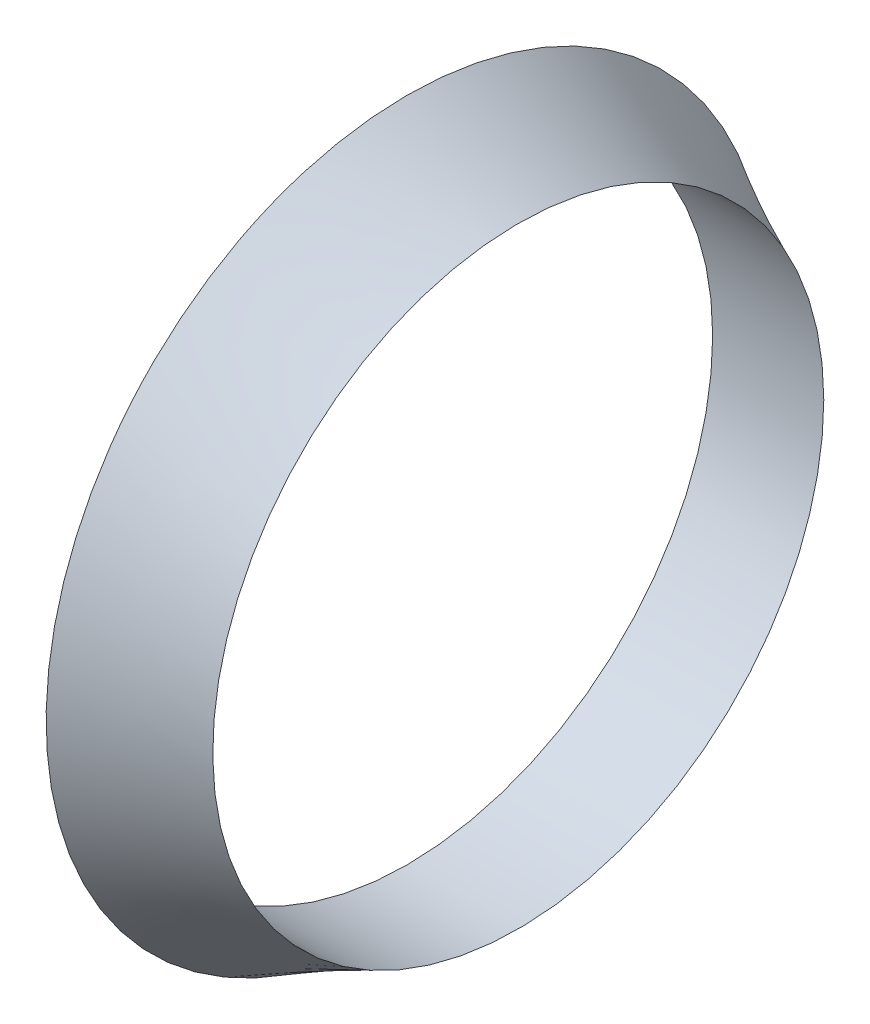
ISO-10303-21;
HEADER;
FILE_DESCRIPTION(('STEP AP214'),'2;1');
FILE_NAME('part.step','',(''),(''),'','','');
FILE_SCHEMA(('AUTOMOTIVE_DESIGN { 1 0 10303 214 1 1 1 1 }'));
ENDSEC;
DATA;
#1=APPLICATION_CONTEXT('core data for automotive mechanical design processes');
#2=APPLICATION_PROTOCOL_DEFINITION('international standard','automotive_design',2000,#1);
#3=PRODUCT_CONTEXT('',#1,'mechanical');
#4=PRODUCT('Part','Part','',(#3));
#5=PRODUCT_RELATED_PRODUCT_CATEGORY('part','',(#4));
#6=PRODUCT_DEFINITION_FORMATION('','',#4);
#7=PRODUCT_DEFINITION_CONTEXT('part definition',#1,'design');
#8=PRODUCT_DEFINITION('design','',#6,#7);
#9=PRODUCT_DEFINITION_SHAPE('','',#8);
#10=(LENGTH_UNIT() NAMED_UNIT(*) SI_UNIT(.MILLI.,.METRE.));
#11=(NAMED_UNIT(*) PLANE_ANGLE_UNIT() SI_UNIT($,.RADIAN.));
#12=(NAMED_UNIT(*) SI_UNIT($,.STERADIAN.) SOLID_ANGLE_UNIT());
#13=UNCERTAINTY_MEASURE_WITH_UNIT(LENGTH_MEASURE(1.E-05),#10,'distance_accuracy_value','');
#14=(GEOMETRIC_REPRESENTATION_CONTEXT(3) GLOBAL_UNCERTAINTY_ASSIGNED_CONTEXT((#13)) GLOBAL_UNIT_ASSIGNED_CONTEXT((#10,
#11,#12)) REPRESENTATION_CONTEXT('',''));
#15=CARTESIAN_POINT('',(0.,0.,0.));
#16=DIRECTION('',(0.,0.,1.));
#17=DIRECTION('',(1.,0.,0.));
#18=AXIS2_PLACEMENT_3D('',#15,#16,#17);
#19=CARTESIAN_POINT('',(0.,0.,0.));
#20=DIRECTION('',(1.,0.,0.));
#21=DIRECTION('',(0.,0.,-1.));
#22=AXIS2_PLACEMENT_3D('',#19,#20,#21);
#23=PLANE('',#22);
#24=CARTESIAN_POINT('',(0.,0.,7.20947868796138E-13));
#25=DIRECTION('',(1.,0.,0.));
#26=DIRECTION('',(0.,0.,-1.));
#27=AXIS2_PLACEMENT_3D('',#24,#25,#26);
#28=CIRCLE('',#27,55.0000000000001);
#29=CARTESIAN_POINT('',(0.,0.,-54.9999999999993));
#30=VERTEX_POINT('',#29);
#31=EDGE_CURVE('E51',#30,#30,#28,.T.);
#32=ORIENTED_EDGE('',*,*,#31,.T.);
#33=EDGE_LOOP('',(#32));
#34=FACE_BOUND('',#33,.T.);
#35=CARTESIAN_POINT('',(0.,0.,0.));
#36=DIRECTION('',(1.,0.,0.));
#37=DIRECTION('',(0.,0.,-1.));
#38=AXIS2_PLACEMENT_3D('',#35,#36,#37);
#39=CIRCLE('',#38,65.);
#40=CARTESIAN_POINT('',(0.,-52.5620886920741,-38.2390746792667));
#41=VERTEX_POINT('',#40);
#42=EDGE_CURVE('E11',#41,#41,#39,.T.);
#43=ORIENTED_EDGE('',*,*,#42,.F.);
#44=EDGE_LOOP('',(#43));
#45=FACE_BOUND('',#44,.T.);
#46=ADVANCED_FACE('F42',(#34,#45),#23,.F.);
#47=CARTESIAN_POINT('',(20.0000000000003,-35.7984123857661,-41.7549239091458));
#48=CARTESIAN_POINT('',(0.,-52.5620886920741,-38.2390746792667));
#49=CARTESIAN_POINT('',(19.9999999999998,-119.308260204059,29.8419008623865));
#50=CARTESIAN_POINT('',(0.,-129.040238050608,66.8851027048815));
#51=CARTESIAN_POINT('',(19.9999999999992,-47.7114354325271,113.35174868068));
#52=CARTESIAN_POINT('',(0.,-23.9160606664593,143.363252063415));
#53=CARTESIAN_POINT('',(19.9999999999997,35.7984123857662,41.7549239091475));
#54=CARTESIAN_POINT('',(0.,52.5620886920741,38.2390746792667));
#55=CARTESIAN_POINT('',(20.0000000000002,119.308260204059,-29.8419008623849));
#56=CARTESIAN_POINT('',(0.,129.040238050608,-66.8851027048813));
#57=CARTESIAN_POINT('',(20.0000000000008,47.7114354325271,-113.351748680678));
#58=CARTESIAN_POINT('',(0.,23.9160606664594,-143.363252063415));
#59=CARTESIAN_POINT('',(20.0000000000003,-35.7984123857661,-41.7549239091458));
#60=CARTESIAN_POINT('',(0.,-52.5620886920741,-38.2390746792667));
#61=(BOUNDED_SURFACE() B_SPLINE_SURFACE(3,1,((#47,#48),(#49,#50),(#51,#52),(#53,#54),(#55,#56),
(#57,#58),(#59,#60)),.UNSPECIFIED.,.T.,.F.,.F.) B_SPLINE_SURFACE_WITH_KNOTS((4,3,4),(2,2),(0.,
0.5,1.),(0.,1.),.UNSPECIFIED.) GEOMETRIC_REPRESENTATION_ITEM() RATIONAL_B_SPLINE_SURFACE(((1.,
1.),(0.333333333333333,0.333333333333333),(0.333333333333333,0.333333333333333),(1.,1.),
(0.333333333333333,0.333333333333334),(0.333333333333333,0.333333333333334),(1.,1.))) REPRESENTATION_ITEM('') SURFACE());
#62=CARTESIAN_POINT('',(20.,0.,8.60607122349863E-13));
#63=DIRECTION('',(1.,0.,0.));
#64=DIRECTION('',(0.,0.,-1.));
#65=AXIS2_PLACEMENT_3D('',#62,#63,#64);
#66=CIRCLE('',#65,55.0000000000001);
#67=CARTESIAN_POINT('',(20.0000000000003,-35.7984123857661,-41.7549239091458));
#68=VERTEX_POINT('',#67);
#69=EDGE_CURVE('E59',#68,#68,#66,.T.);
#70=CARTESIAN_POINT('',(20.0000000000003,-35.7984123857661,-41.7549239091458));
#71=CARTESIAN_POINT('',(19.791666666667,-35.9730340139568,-41.7183004796679));
#72=CARTESIAN_POINT('',(19.5833333333336,-36.1476556421476,-41.68167705019));
#73=CARTESIAN_POINT('',(19.1666666666669,-36.496898898529,-41.6084301912341));
#74=CARTESIAN_POINT('',(18.9583333333336,-36.6715205267197,-41.5718067617562));
#75=CARTESIAN_POINT('',(18.5416666666669,-37.0207637831011,-41.4985599028004));
#76=CARTESIAN_POINT('',(18.3333333333336,-37.1953854112918,-41.4619364733225));
#77=CARTESIAN_POINT('',(17.9166666666669,-37.5446286676732,-41.3886896143667));
#78=CARTESIAN_POINT('',(17.7083333333336,-37.7192502958639,-41.3520661848888));
#79=CARTESIAN_POINT('',(17.2916666666669,-38.0684935522454,-41.278819325933));
#80=CARTESIAN_POINT('',(17.0833333333336,-38.243115180436,-41.2421958964551));
#81=CARTESIAN_POINT('',(16.6666666666669,-38.5923584368175,-41.1689490374993));
#82=CARTESIAN_POINT('',(16.4583333333336,-38.7669800650082,-41.1323256080214));
#83=CARTESIAN_POINT('',(16.0416666666669,-39.1162233213896,-41.0590787490655));
#84=CARTESIAN_POINT('',(15.8333333333336,-39.2908449495803,-41.0224553195876));
#85=CARTESIAN_POINT('',(15.4166666666669,-39.6400882059617,-40.9492084606318));
#86=CARTESIAN_POINT('',(15.2083333333336,-39.8147098341524,-40.9125850311539));
#87=CARTESIAN_POINT('',(14.7916666666669,-40.1639530905338,-40.8393381721981));
#88=CARTESIAN_POINT('',(14.5833333333335,-40.3385747187245,-40.8027147427202));
#89=CARTESIAN_POINT('',(14.1666666666669,-40.687817975106,-40.7294678837644));
#90=CARTESIAN_POINT('',(13.9583333333335,-40.8624396032967,-40.6928444542865));
#91=CARTESIAN_POINT('',(13.5416666666669,-41.2116828596781,-40.6195975953307));
#92=CARTESIAN_POINT('',(13.3333333333335,-41.3863044878688,-40.5829741658527));
#93=CARTESIAN_POINT('',(12.9166666666669,-41.7355477442502,-40.5097273068969));
#94=CARTESIAN_POINT('',(12.7083333333335,-41.9101693724409,-40.473103877419));
#95=CARTESIAN_POINT('',(12.2916666666668,-42.2594126288223,-40.3998570184632));
#96=CARTESIAN_POINT('',(12.0833333333335,-42.434034257013,-40.3632335889853));
#97=CARTESIAN_POINT('',(11.6666666666668,-42.7832775133945,-40.2899867300295));
#98=CARTESIAN_POINT('',(11.4583333333335,-42.9578991415852,-40.2533633005516));
#99=CARTESIAN_POINT('',(11.0416666666668,-43.3071423979666,-40.1801164415958));
#100=CARTESIAN_POINT('',(10.8333333333335,-43.4817640261573,-40.1434930121179));
#101=CARTESIAN_POINT('',(10.4166666666668,-43.8310072825387,-40.0702461531621));
#102=CARTESIAN_POINT('',(10.2083333333335,-44.0056289107294,-40.0336227236842));
#103=CARTESIAN_POINT('',(9.79166666666681,-44.3548721671108,-39.9603758647283));
#104=CARTESIAN_POINT('',(9.58333333333347,-44.5294937953015,-39.9237524352504));
#105=CARTESIAN_POINT('',(9.1666666666668,-44.878737051683,-39.8505055762946));
#106=CARTESIAN_POINT('',(8.95833333333346,-45.0533586798737,-39.8138821468167));
#107=CARTESIAN_POINT('',(8.54166666666679,-45.4026019362551,-39.7406352878609));
#108=CARTESIAN_POINT('',(8.33333333333345,-45.5772235644458,-39.704011858383));
#109=CARTESIAN_POINT('',(7.91666666666678,-45.9264668208272,-39.6307649994272));
#110=CARTESIAN_POINT('',(7.70833333333345,-46.1010884490179,-39.5941415699493));
#111=CARTESIAN_POINT('',(7.29166666666677,-46.4503317053993,-39.5208947109935));
#112=CARTESIAN_POINT('',(7.08333333333344,-46.62495333359,-39.4842712815156));
#113=CARTESIAN_POINT('',(6.66666666666676,-46.9741965899714,-39.4110244225597));
#114=CARTESIAN_POINT('',(6.45833333333343,-47.1488182181622,-39.3744009930818));
#115=CARTESIAN_POINT('',(6.04166666666676,-47.4980614745436,-39.301154134126));
#116=CARTESIAN_POINT('',(5.83333333333342,-47.6726831027343,-39.2645307046481));
#117=CARTESIAN_POINT('',(5.41666666666675,-48.0219263591157,-39.1912838456923));
#118=CARTESIAN_POINT('',(5.20833333333341,-48.1965479873064,-39.1546604162144));
#119=CARTESIAN_POINT('',(4.79166666666674,-48.5457912436878,-39.0814135572586));
#120=CARTESIAN_POINT('',(4.5833333333334,-48.7204128718785,-39.0447901277807));
#121=CARTESIAN_POINT('',(4.16666666666673,-49.06965612826,-38.9715432688249));
#122=CARTESIAN_POINT('',(3.95833333333339,-49.2442777564507,-38.934919839347));
#123=CARTESIAN_POINT('',(3.54166666666672,-49.5935210128321,-38.8616729803911));
#124=CARTESIAN_POINT('',(3.33333333333338,-49.7681426410228,-38.8250495509132));
#125=CARTESIAN_POINT('',(2.91666666666671,-50.1173858974042,-38.7518026919574));
#126=CARTESIAN_POINT('',(2.70833333333337,-50.2920075255949,-38.7151792624795));
#127=CARTESIAN_POINT('',(2.2916666666667,-50.6412507819763,-38.6419324035237));
#128=CARTESIAN_POINT('',(2.08333333333336,-50.815872410167,-38.6053089740458));
#129=CARTESIAN_POINT('',(1.66666666666669,-51.1651156665484,-38.53206211509));
#130=CARTESIAN_POINT('',(1.45833333333335,-51.3397372947391,-38.4954386856121));
#131=CARTESIAN_POINT('',(1.04166666666668,-51.6889805511206,-38.4221918266563));
#132=CARTESIAN_POINT('',(0.833333333333345,-51.8636021793113,-38.3855683971784));
#133=CARTESIAN_POINT('',(0.416666666666674,-52.2128454356927,-38.3123215382225));
#134=CARTESIAN_POINT('',(0.208333333333339,-52.3874670638834,-38.2756981087446));
#135=CARTESIAN_POINT('',(0.,-52.5620886920741,-38.2390746792667));
#136=B_SPLINE_CURVE_WITH_KNOTS('',3,(#70,#71,#72,#73,#74,#75,#76,#77,#78,#79,#80,#81,#82,#83,
#84,#85,#86,#87,#88,#89,#90,#91,#92,#93,#94,#95,#96,#97,#98,#99,#100,#101,#102,#103,#104,#105,
#106,#107,#108,#109,#110,#111,#112,#113,#114,#115,#116,#117,#118,#119,#120,#121,#122,#123,#124,
#125,#126,#127,#128,#129,#130,#131,#132,#133,#134,#135),.UNSPECIFIED.,.F.,.F.,(4,2,2,2,2,2,2,2,
2,2,2,2,2,2,2,2,2,2,2,2,2,2,2,2,2,2,2,2,2,2,2,2,4),(0.,0.822879637351831,1.64575927470367,
2.4686389120555,3.29151854940734,4.11439818675916,4.937277824111,5.76015746146283,
6.58303709881467,7.4059167361665,8.22879637351833,9.05167601087017,9.874555648222,
10.6974352855738,11.5203149229257,12.3431945602775,13.1660741976293,13.9889538349812,
14.811833472333,15.6347131096848,16.4575927470367,17.2804723843885,18.1033520217403,
18.9262316590922,19.749111296444,20.5719909337958,21.3948705711477,22.2177502084995,
23.0406298458513,23.8635094832032,24.686389120555,25.5092687579068,26.3321483952587),.UNSPECIFIED.);
#137=EDGE_CURVE('BSEAM83',#68,#41,#136,.T.);
#138=ORIENTED_EDGE('',*,*,#69,.F.);
#139=ORIENTED_EDGE('',*,*,#42,.T.);
#140=ORIENTED_EDGE('',*,*,#137,.T.);
#141=ORIENTED_EDGE('',*,*,#137,.F.);
#142=EDGE_LOOP('',(#138,#140,#139,#141));
#143=FACE_BOUND('',#142,.T.);
#144=ADVANCED_FACE('F83',(#143),#61,.T.);
#145=CARTESIAN_POINT('',(-10.,0.,6.51118242019275E-13));
#146=DIRECTION('',(1.,0.,0.));
#147=DIRECTION('',(0.,0.,-1.));
#148=AXIS2_PLACEMENT_3D('',#145,#146,#147);
#149=CYLINDRICAL_SURFACE('',#148,55.0000000000001);
#150=ORIENTED_EDGE('',*,*,#69,.T.);
#151=EDGE_LOOP('',(#150));
#152=FACE_BOUND('',#151,.T.);
#153=ORIENTED_EDGE('',*,*,#31,.F.);
#154=EDGE_LOOP('',(#153));
#155=FACE_BOUND('',#154,.T.);
#156=ADVANCED_FACE('F75',(#152,#155),#149,.F.);
#157=CLOSED_SHELL('',(#46,#144,#156));
#158=MANIFOLD_SOLID_BREP('B2',#157);
#159=ADVANCED_BREP_SHAPE_REPRESENTATION('',(#18,#158),#14);
#160=SHAPE_DEFINITION_REPRESENTATION(#9,#159);
ENDSEC;
END-ISO-10303-21;
